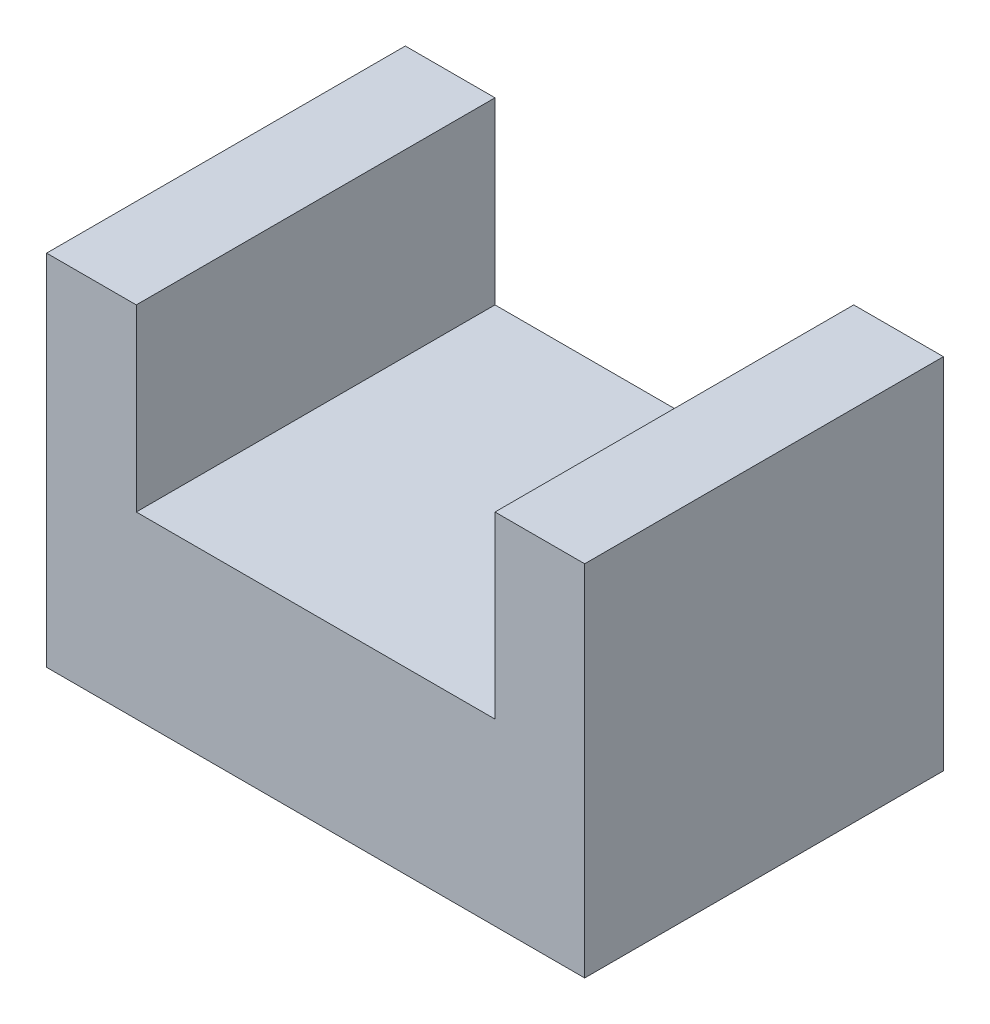
ISO-10303-21;
HEADER;
FILE_DESCRIPTION(('STEP AP214'),'2;1');
FILE_NAME('part.step','',(''),(''),'','','');
FILE_SCHEMA(('AUTOMOTIVE_DESIGN { 1 0 10303 214 1 1 1 1 }'));
ENDSEC;
DATA;
#1=APPLICATION_CONTEXT('core data for automotive mechanical design processes');
#2=APPLICATION_PROTOCOL_DEFINITION('international standard','automotive_design',2000,#1);
#3=PRODUCT_CONTEXT('',#1,'mechanical');
#4=PRODUCT('Part','Part','',(#3));
#5=PRODUCT_RELATED_PRODUCT_CATEGORY('part','',(#4));
#6=PRODUCT_DEFINITION_FORMATION('','',#4);
#7=PRODUCT_DEFINITION_CONTEXT('part definition',#1,'design');
#8=PRODUCT_DEFINITION('design','',#6,#7);
#9=PRODUCT_DEFINITION_SHAPE('','',#8);
#10=(LENGTH_UNIT() NAMED_UNIT(*) SI_UNIT(.MILLI.,.METRE.));
#11=(NAMED_UNIT(*) PLANE_ANGLE_UNIT() SI_UNIT($,.RADIAN.));
#12=(NAMED_UNIT(*) SI_UNIT($,.STERADIAN.) SOLID_ANGLE_UNIT());
#13=UNCERTAINTY_MEASURE_WITH_UNIT(LENGTH_MEASURE(1.E-05),#10,'distance_accuracy_value','');
#14=(GEOMETRIC_REPRESENTATION_CONTEXT(3) GLOBAL_UNCERTAINTY_ASSIGNED_CONTEXT((#13)) GLOBAL_UNIT_ASSIGNED_CONTEXT((#10,
#11,#12)) REPRESENTATION_CONTEXT('',''));
#15=CARTESIAN_POINT('',(0.,0.,0.));
#16=DIRECTION('',(0.,0.,1.));
#17=DIRECTION('',(1.,0.,0.));
#18=AXIS2_PLACEMENT_3D('',#15,#16,#17);
#19=CARTESIAN_POINT('',(-30.8236786469344,33.938266384778,50.8));
#20=DIRECTION('',(0.,-1.,0.));
#21=DIRECTION('',(1.,0.,0.));
#22=AXIS2_PLACEMENT_3D('',#19,#20,#21);
#23=PLANE('',#22);
#24=DIRECTION('',(-1.,0.,0.));
#25=VECTOR('',#24,1.);
#26=CARTESIAN_POINT('',(-30.8236786469344,33.938266384778,0.));
#27=LINE('',#26,#25);
#28=CARTESIAN_POINT('',(-30.8236786469344,33.938266384778,0.));
#29=VERTEX_POINT('',#28);
#30=CARTESIAN_POINT('',(-43.5236786469344,33.938266384778,0.));
#31=VERTEX_POINT('',#30);
#32=EDGE_CURVE('E128',#29,#31,#27,.T.);
#33=ORIENTED_EDGE('',*,*,#32,.T.);
#34=DIRECTION('',(0.,0.,-1.));
#35=VECTOR('',#34,1.);
#36=CARTESIAN_POINT('',(-43.5236786469344,33.938266384778,50.8));
#37=LINE('',#36,#35);
#38=CARTESIAN_POINT('',(-43.5236786469344,33.938266384778,50.8));
#39=VERTEX_POINT('',#38);
#40=EDGE_CURVE('E11',#39,#31,#37,.T.);
#41=ORIENTED_EDGE('',*,*,#40,.F.);
#42=DIRECTION('',(-1.,0.,0.));
#43=VECTOR('',#42,1.);
#44=CARTESIAN_POINT('',(-30.8236786469344,33.938266384778,50.8));
#45=LINE('',#44,#43);
#46=CARTESIAN_POINT('',(-30.8236786469344,33.938266384778,50.8));
#47=VERTEX_POINT('',#46);
#48=EDGE_CURVE('E142',#47,#39,#45,.T.);
#49=ORIENTED_EDGE('',*,*,#48,.F.);
#50=DIRECTION('',(0.,0.,-1.));
#51=VECTOR('',#50,1.);
#52=CARTESIAN_POINT('',(-30.8236786469344,33.938266384778,50.8));
#53=LINE('',#52,#51);
#54=EDGE_CURVE('E124',#47,#29,#53,.T.);
#55=ORIENTED_EDGE('',*,*,#54,.T.);
#56=EDGE_LOOP('',(#33,#41,#49,#55));
#57=FACE_BOUND('',#56,.T.);
#58=ADVANCED_FACE('F32',(#57),#23,.F.);
#59=CARTESIAN_POINT('',(-43.5236786469344,33.938266384778,50.8));
#60=DIRECTION('',(1.,0.,0.));
#61=DIRECTION('',(0.,1.,0.));
#62=AXIS2_PLACEMENT_3D('',#59,#60,#61);
#63=PLANE('',#62);
#64=DIRECTION('',(0.,-1.,0.));
#65=VECTOR('',#64,1.);
#66=CARTESIAN_POINT('',(-43.5236786469344,33.938266384778,0.));
#67=LINE('',#66,#65);
#68=CARTESIAN_POINT('',(-43.5236786469344,-16.861733615222,0.));
#69=VERTEX_POINT('',#68);
#70=EDGE_CURVE('E131',#31,#69,#67,.T.);
#71=ORIENTED_EDGE('',*,*,#70,.T.);
#72=DIRECTION('',(0.,0.,-1.));
#73=VECTOR('',#72,1.);
#74=CARTESIAN_POINT('',(-43.5236786469344,-16.861733615222,50.8));
#75=LINE('',#74,#73);
#76=CARTESIAN_POINT('',(-43.5236786469344,-16.861733615222,50.8));
#77=VERTEX_POINT('',#76);
#78=EDGE_CURVE('E40',#77,#69,#75,.T.);
#79=ORIENTED_EDGE('',*,*,#78,.F.);
#80=DIRECTION('',(0.,-1.,0.));
#81=VECTOR('',#80,1.);
#82=CARTESIAN_POINT('',(-43.5236786469344,33.938266384778,50.8));
#83=LINE('',#82,#81);
#84=EDGE_CURVE('E91',#39,#77,#83,.T.);
#85=ORIENTED_EDGE('',*,*,#84,.F.);
#86=ORIENTED_EDGE('',*,*,#40,.T.);
#87=EDGE_LOOP('',(#71,#79,#85,#86));
#88=FACE_BOUND('',#87,.T.);
#89=ADVANCED_FACE('F177',(#88),#63,.F.);
#90=CARTESIAN_POINT('',(-43.5236786469344,-16.861733615222,50.8));
#91=DIRECTION('',(0.,1.,0.));
#92=DIRECTION('',(-1.,0.,0.));
#93=AXIS2_PLACEMENT_3D('',#90,#91,#92);
#94=PLANE('',#93);
#95=DIRECTION('',(1.,0.,0.));
#96=VECTOR('',#95,1.);
#97=CARTESIAN_POINT('',(-43.5236786469344,-16.861733615222,0.));
#98=LINE('',#97,#96);
#99=CARTESIAN_POINT('',(32.6763213530656,-16.861733615222,0.));
#100=VERTEX_POINT('',#99);
#101=EDGE_CURVE('E133',#69,#100,#98,.T.);
#102=ORIENTED_EDGE('',*,*,#101,.T.);
#103=DIRECTION('',(0.,0.,-1.));
#104=VECTOR('',#103,1.);
#105=CARTESIAN_POINT('',(32.6763213530656,-16.861733615222,50.8));
#106=LINE('',#105,#104);
#107=CARTESIAN_POINT('',(32.6763213530656,-16.861733615222,50.8));
#108=VERTEX_POINT('',#107);
#109=EDGE_CURVE('E149',#108,#100,#106,.T.);
#110=ORIENTED_EDGE('',*,*,#109,.F.);
#111=DIRECTION('',(1.,0.,0.));
#112=VECTOR('',#111,1.);
#113=CARTESIAN_POINT('',(-43.5236786469344,-16.861733615222,50.8));
#114=LINE('',#113,#112);
#115=EDGE_CURVE('E157',#77,#108,#114,.T.);
#116=ORIENTED_EDGE('',*,*,#115,.F.);
#117=ORIENTED_EDGE('',*,*,#78,.T.);
#118=EDGE_LOOP('',(#102,#110,#116,#117));
#119=FACE_BOUND('',#118,.T.);
#120=ADVANCED_FACE('F155',(#119),#94,.F.);
#121=CARTESIAN_POINT('',(32.6763213530656,-16.861733615222,50.8));
#122=DIRECTION('',(-1.,0.,0.));
#123=DIRECTION('',(0.,-1.,0.));
#124=AXIS2_PLACEMENT_3D('',#121,#122,#123);
#125=PLANE('',#124);
#126=DIRECTION('',(0.,1.,0.));
#127=VECTOR('',#126,1.);
#128=CARTESIAN_POINT('',(32.6763213530656,-16.861733615222,0.));
#129=LINE('',#128,#127);
#130=CARTESIAN_POINT('',(32.6763213530656,33.938266384778,0.));
#131=VERTEX_POINT('',#130);
#132=EDGE_CURVE('E135',#100,#131,#129,.T.);
#133=ORIENTED_EDGE('',*,*,#132,.T.);
#134=DIRECTION('',(0.,0.,-1.));
#135=VECTOR('',#134,1.);
#136=CARTESIAN_POINT('',(32.6763213530656,33.938266384778,50.8));
#137=LINE('',#136,#135);
#138=CARTESIAN_POINT('',(32.6763213530656,33.938266384778,50.8));
#139=VERTEX_POINT('',#138);
#140=EDGE_CURVE('E146',#139,#131,#137,.T.);
#141=ORIENTED_EDGE('',*,*,#140,.F.);
#142=DIRECTION('',(0.,1.,0.));
#143=VECTOR('',#142,1.);
#144=CARTESIAN_POINT('',(32.6763213530656,-16.861733615222,50.8));
#145=LINE('',#144,#143);
#146=EDGE_CURVE('E169',#108,#139,#145,.T.);
#147=ORIENTED_EDGE('',*,*,#146,.F.);
#148=ORIENTED_EDGE('',*,*,#109,.T.);
#149=EDGE_LOOP('',(#133,#141,#147,#148));
#150=FACE_BOUND('',#149,.T.);
#151=ADVANCED_FACE('F165',(#150),#125,.F.);
#152=CARTESIAN_POINT('',(32.6763213530656,33.938266384778,50.8));
#153=DIRECTION('',(0.,-1.,0.));
#154=DIRECTION('',(0.,0.,-1.));
#155=AXIS2_PLACEMENT_3D('',#152,#153,#154);
#156=PLANE('',#155);
#157=DIRECTION('',(-1.,0.,0.));
#158=VECTOR('',#157,1.);
#159=CARTESIAN_POINT('',(32.6763213530656,33.938266384778,0.));
#160=LINE('',#159,#158);
#161=CARTESIAN_POINT('',(19.9763213530656,33.938266384778,0.));
#162=VERTEX_POINT('',#161);
#163=EDGE_CURVE('E137',#131,#162,#160,.T.);
#164=ORIENTED_EDGE('',*,*,#163,.T.);
#165=DIRECTION('',(0.,0.,-1.));
#166=VECTOR('',#165,1.);
#167=CARTESIAN_POINT('',(19.9763213530656,33.938266384778,50.8));
#168=LINE('',#167,#166);
#169=CARTESIAN_POINT('',(19.9763213530656,33.938266384778,50.8));
#170=VERTEX_POINT('',#169);
#171=EDGE_CURVE('E119',#170,#162,#168,.T.);
#172=ORIENTED_EDGE('',*,*,#171,.F.);
#173=DIRECTION('',(-1.,0.,0.));
#174=VECTOR('',#173,1.);
#175=CARTESIAN_POINT('',(32.6763213530656,33.938266384778,50.8));
#176=LINE('',#175,#174);
#177=EDGE_CURVE('E110',#139,#170,#176,.T.);
#178=ORIENTED_EDGE('',*,*,#177,.F.);
#179=ORIENTED_EDGE('',*,*,#140,.T.);
#180=EDGE_LOOP('',(#164,#172,#178,#179));
#181=FACE_BOUND('',#180,.T.);
#182=ADVANCED_FACE('F168',(#181),#156,.F.);
#183=CARTESIAN_POINT('',(19.9763213530656,33.938266384778,50.8));
#184=DIRECTION('',(1.,0.,0.));
#185=DIRECTION('',(0.,0.,-1.));
#186=AXIS2_PLACEMENT_3D('',#183,#184,#185);
#187=PLANE('',#186);
#188=DIRECTION('',(0.,-1.,0.));
#189=VECTOR('',#188,1.);
#190=CARTESIAN_POINT('',(19.9763213530656,33.938266384778,0.));
#191=LINE('',#190,#189);
#192=CARTESIAN_POINT('',(19.9763213530656,8.53826638477801,0.));
#193=VERTEX_POINT('',#192);
#194=EDGE_CURVE('E118',#162,#193,#191,.T.);
#195=ORIENTED_EDGE('',*,*,#194,.T.);
#196=DIRECTION('',(0.,0.,-1.));
#197=VECTOR('',#196,1.);
#198=CARTESIAN_POINT('',(19.9763213530656,8.53826638477801,50.8));
#199=LINE('',#198,#197);
#200=CARTESIAN_POINT('',(19.9763213530656,8.53826638477801,50.8));
#201=VERTEX_POINT('',#200);
#202=EDGE_CURVE('E115',#201,#193,#199,.T.);
#203=ORIENTED_EDGE('',*,*,#202,.F.);
#204=DIRECTION('',(0.,-1.,0.));
#205=VECTOR('',#204,1.);
#206=CARTESIAN_POINT('',(19.9763213530656,33.938266384778,50.8));
#207=LINE('',#206,#205);
#208=EDGE_CURVE('E104',#170,#201,#207,.T.);
#209=ORIENTED_EDGE('',*,*,#208,.F.);
#210=ORIENTED_EDGE('',*,*,#171,.T.);
#211=EDGE_LOOP('',(#195,#203,#209,#210));
#212=FACE_BOUND('',#211,.T.);
#213=ADVANCED_FACE('F116',(#212),#187,.F.);
#214=CARTESIAN_POINT('',(19.9763213530656,8.53826638477801,50.8));
#215=DIRECTION('',(0.,-1.,0.));
#216=DIRECTION('',(1.,0.,0.));
#217=AXIS2_PLACEMENT_3D('',#214,#215,#216);
#218=PLANE('',#217);
#219=DIRECTION('',(-1.,0.,0.));
#220=VECTOR('',#219,1.);
#221=CARTESIAN_POINT('',(19.9763213530656,8.53826638477801,0.));
#222=LINE('',#221,#220);
#223=CARTESIAN_POINT('',(-30.8236786469344,8.538266384778,0.));
#224=VERTEX_POINT('',#223);
#225=EDGE_CURVE('E77',#193,#224,#222,.T.);
#226=ORIENTED_EDGE('',*,*,#225,.T.);
#227=DIRECTION('',(0.,0.,-1.));
#228=VECTOR('',#227,1.);
#229=CARTESIAN_POINT('',(-30.8236786469344,8.538266384778,50.8));
#230=LINE('',#229,#228);
#231=CARTESIAN_POINT('',(-30.8236786469344,8.538266384778,50.8));
#232=VERTEX_POINT('',#231);
#233=EDGE_CURVE('E120',#232,#224,#230,.T.);
#234=ORIENTED_EDGE('',*,*,#233,.F.);
#235=DIRECTION('',(-1.,0.,0.));
#236=VECTOR('',#235,1.);
#237=CARTESIAN_POINT('',(19.9763213530656,8.53826638477801,50.8));
#238=LINE('',#237,#236);
#239=EDGE_CURVE('E108',#201,#232,#238,.T.);
#240=ORIENTED_EDGE('',*,*,#239,.F.);
#241=ORIENTED_EDGE('',*,*,#202,.T.);
#242=EDGE_LOOP('',(#226,#234,#240,#241));
#243=FACE_BOUND('',#242,.T.);
#244=ADVANCED_FACE('F122',(#243),#218,.F.);
#245=CARTESIAN_POINT('',(-30.8236786469344,8.538266384778,50.8));
#246=DIRECTION('',(-1.,0.,0.));
#247=DIRECTION('',(0.,0.,1.));
#248=AXIS2_PLACEMENT_3D('',#245,#246,#247);
#249=PLANE('',#248);
#250=DIRECTION('',(0.,1.,0.));
#251=VECTOR('',#250,1.);
#252=CARTESIAN_POINT('',(-30.8236786469344,8.538266384778,0.));
#253=LINE('',#252,#251);
#254=EDGE_CURVE('E83',#224,#29,#253,.T.);
#255=ORIENTED_EDGE('',*,*,#254,.T.);
#256=ORIENTED_EDGE('',*,*,#54,.F.);
#257=DIRECTION('',(0.,1.,0.));
#258=VECTOR('',#257,1.);
#259=CARTESIAN_POINT('',(-30.8236786469344,8.538266384778,50.8));
#260=LINE('',#259,#258);
#261=EDGE_CURVE('E48',#232,#47,#260,.T.);
#262=ORIENTED_EDGE('',*,*,#261,.F.);
#263=ORIENTED_EDGE('',*,*,#233,.T.);
#264=EDGE_LOOP('',(#255,#256,#262,#263));
#265=FACE_BOUND('',#264,.T.);
#266=ADVANCED_FACE('F193',(#265),#249,.F.);
#267=CARTESIAN_POINT('',(0.,0.,50.8));
#268=DIRECTION('',(0.,0.,1.));
#269=DIRECTION('',(1.,0.,0.));
#270=AXIS2_PLACEMENT_3D('',#267,#268,#269);
#271=PLANE('',#270);
#272=ORIENTED_EDGE('',*,*,#48,.T.);
#273=ORIENTED_EDGE('',*,*,#84,.T.);
#274=ORIENTED_EDGE('',*,*,#115,.T.);
#275=ORIENTED_EDGE('',*,*,#146,.T.);
#276=ORIENTED_EDGE('',*,*,#177,.T.);
#277=ORIENTED_EDGE('',*,*,#208,.T.);
#278=ORIENTED_EDGE('',*,*,#239,.T.);
#279=ORIENTED_EDGE('',*,*,#261,.T.);
#280=EDGE_LOOP('',(#272,#273,#274,#275,#276,#277,#278,#279));
#281=FACE_BOUND('',#280,.T.);
#282=ADVANCED_FACE('F106',(#281),#271,.T.);
#283=CARTESIAN_POINT('',(0.,0.,0.));
#284=DIRECTION('',(0.,0.,1.));
#285=DIRECTION('',(1.,0.,0.));
#286=AXIS2_PLACEMENT_3D('',#283,#284,#285);
#287=PLANE('',#286);
#288=ORIENTED_EDGE('',*,*,#32,.F.);
#289=ORIENTED_EDGE('',*,*,#254,.F.);
#290=ORIENTED_EDGE('',*,*,#225,.F.);
#291=ORIENTED_EDGE('',*,*,#194,.F.);
#292=ORIENTED_EDGE('',*,*,#163,.F.);
#293=ORIENTED_EDGE('',*,*,#132,.F.);
#294=ORIENTED_EDGE('',*,*,#101,.F.);
#295=ORIENTED_EDGE('',*,*,#70,.F.);
#296=EDGE_LOOP('',(#288,#289,#290,#291,#292,#293,#294,#295));
#297=FACE_BOUND('',#296,.T.);
#298=ADVANCED_FACE('F161',(#297),#287,.F.);
#299=CLOSED_SHELL('',(#58,#89,#120,#151,#182,#213,#244,#266,#282,#298));
#300=MANIFOLD_SOLID_BREP('B2',#299);
#301=ADVANCED_BREP_SHAPE_REPRESENTATION('',(#18,#300),#14);
#302=SHAPE_DEFINITION_REPRESENTATION(#9,#301);
ENDSEC;
END-ISO-10303-21;
